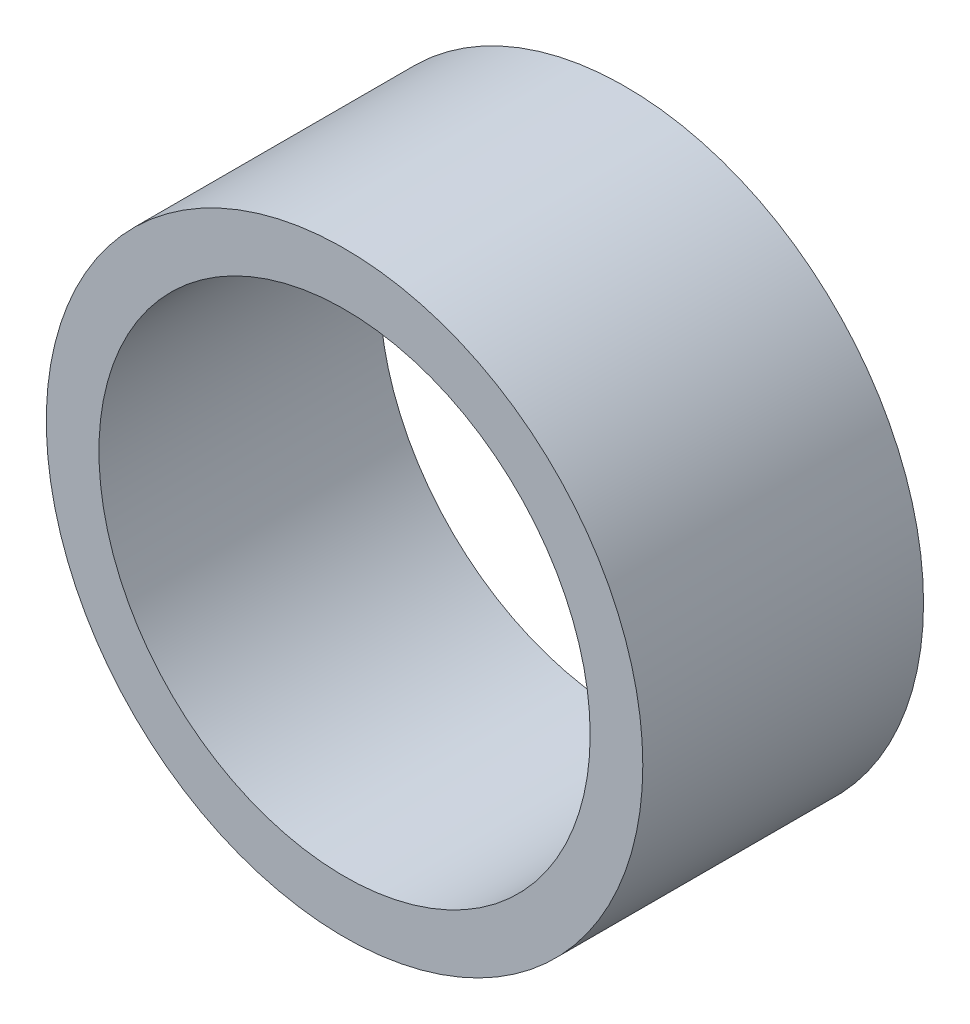
ISO-10303-21;
HEADER;
FILE_DESCRIPTION(('STEP AP214'),'2;1');
FILE_NAME('part.step','',(''),(''),'','','');
FILE_SCHEMA(('AUTOMOTIVE_DESIGN { 1 0 10303 214 1 1 1 1 }'));
ENDSEC;
DATA;
#1=APPLICATION_CONTEXT('core data for automotive mechanical design processes');
#2=APPLICATION_PROTOCOL_DEFINITION('international standard','automotive_design',2000,#1);
#3=PRODUCT_CONTEXT('',#1,'mechanical');
#4=PRODUCT('Part','Part','',(#3));
#5=PRODUCT_RELATED_PRODUCT_CATEGORY('part','',(#4));
#6=PRODUCT_DEFINITION_FORMATION('','',#4);
#7=PRODUCT_DEFINITION_CONTEXT('part definition',#1,'design');
#8=PRODUCT_DEFINITION('design','',#6,#7);
#9=PRODUCT_DEFINITION_SHAPE('','',#8);
#10=(LENGTH_UNIT() NAMED_UNIT(*) SI_UNIT(.MILLI.,.METRE.));
#11=(NAMED_UNIT(*) PLANE_ANGLE_UNIT() SI_UNIT($,.RADIAN.));
#12=(NAMED_UNIT(*) SI_UNIT($,.STERADIAN.) SOLID_ANGLE_UNIT());
#13=UNCERTAINTY_MEASURE_WITH_UNIT(LENGTH_MEASURE(1.E-05),#10,'distance_accuracy_value','');
#14=(GEOMETRIC_REPRESENTATION_CONTEXT(3) GLOBAL_UNCERTAINTY_ASSIGNED_CONTEXT((#13)) GLOBAL_UNIT_ASSIGNED_CONTEXT((#10,
#11,#12)) REPRESENTATION_CONTEXT('',''));
#15=CARTESIAN_POINT('',(0.,0.,0.));
#16=DIRECTION('',(0.,0.,1.));
#17=DIRECTION('',(1.,0.,0.));
#18=AXIS2_PLACEMENT_3D('',#15,#16,#17);
#19=CARTESIAN_POINT('',(0.,0.,8.));
#20=DIRECTION('',(0.,0.,1.));
#21=DIRECTION('',(1.,0.,0.));
#22=AXIS2_PLACEMENT_3D('',#19,#20,#21);
#23=PLANE('',#22);
#24=CARTESIAN_POINT('',(0.,0.,8.));
#25=DIRECTION('',(0.,0.,1.));
#26=DIRECTION('',(1.,0.,0.));
#27=AXIS2_PLACEMENT_3D('',#24,#25,#26);
#28=CIRCLE('',#27,8.5);
#29=CARTESIAN_POINT('',(8.5,0.,8.));
#30=VERTEX_POINT('',#29);
#31=EDGE_CURVE('E11',#30,#30,#28,.T.);
#32=ORIENTED_EDGE('',*,*,#31,.T.);
#33=EDGE_LOOP('',(#32));
#34=FACE_BOUND('',#33,.T.);
#35=CARTESIAN_POINT('',(0.,0.,8.));
#36=DIRECTION('',(0.,0.,1.));
#37=DIRECTION('',(1.,0.,0.));
#38=AXIS2_PLACEMENT_3D('',#35,#36,#37);
#39=CIRCLE('',#38,7.);
#40=CARTESIAN_POINT('',(7.,0.,8.));
#41=VERTEX_POINT('',#40);
#42=EDGE_CURVE('E47',#41,#41,#39,.T.);
#43=ORIENTED_EDGE('',*,*,#42,.F.);
#44=EDGE_LOOP('',(#43));
#45=FACE_BOUND('',#44,.T.);
#46=ADVANCED_FACE('F36',(#34,#45),#23,.T.);
#47=CARTESIAN_POINT('',(0.,0.,0.));
#48=DIRECTION('',(0.,0.,1.));
#49=DIRECTION('',(1.,0.,0.));
#50=AXIS2_PLACEMENT_3D('',#47,#48,#49);
#51=PLANE('',#50);
#52=CARTESIAN_POINT('',(0.,0.,0.));
#53=DIRECTION('',(0.,0.,1.));
#54=DIRECTION('',(1.,0.,0.));
#55=AXIS2_PLACEMENT_3D('',#52,#53,#54);
#56=CIRCLE('',#55,8.5);
#57=CARTESIAN_POINT('',(8.5,0.,0.));
#58=VERTEX_POINT('',#57);
#59=EDGE_CURVE('E40',#58,#58,#56,.T.);
#60=ORIENTED_EDGE('',*,*,#59,.F.);
#61=EDGE_LOOP('',(#60));
#62=FACE_BOUND('',#61,.T.);
#63=CARTESIAN_POINT('',(0.,0.,0.));
#64=DIRECTION('',(0.,0.,1.));
#65=DIRECTION('',(1.,0.,0.));
#66=AXIS2_PLACEMENT_3D('',#63,#64,#65);
#67=CIRCLE('',#66,7.);
#68=CARTESIAN_POINT('',(7.,0.,0.));
#69=VERTEX_POINT('',#68);
#70=EDGE_CURVE('E49',#69,#69,#67,.T.);
#71=ORIENTED_EDGE('',*,*,#70,.T.);
#72=EDGE_LOOP('',(#71));
#73=FACE_BOUND('',#72,.T.);
#74=ADVANCED_FACE('F59',(#62,#73),#51,.F.);
#75=CARTESIAN_POINT('',(0.,0.,8.));
#76=DIRECTION('',(0.,0.,-1.));
#77=DIRECTION('',(-1.,0.,0.));
#78=AXIS2_PLACEMENT_3D('',#75,#76,#77);
#79=CYLINDRICAL_SURFACE('',#78,8.5);
#80=ORIENTED_EDGE('',*,*,#31,.F.);
#81=EDGE_LOOP('',(#80));
#82=FACE_BOUND('',#81,.T.);
#83=ORIENTED_EDGE('',*,*,#59,.T.);
#84=EDGE_LOOP('',(#83));
#85=FACE_BOUND('',#84,.T.);
#86=ADVANCED_FACE('F38',(#82,#85),#79,.T.);
#87=CARTESIAN_POINT('',(0.,0.,8.));
#88=DIRECTION('',(0.,0.,-1.));
#89=DIRECTION('',(-1.,0.,0.));
#90=AXIS2_PLACEMENT_3D('',#87,#88,#89);
#91=CYLINDRICAL_SURFACE('',#90,7.);
#92=ORIENTED_EDGE('',*,*,#42,.T.);
#93=EDGE_LOOP('',(#92));
#94=FACE_BOUND('',#93,.T.);
#95=ORIENTED_EDGE('',*,*,#70,.F.);
#96=EDGE_LOOP('',(#95));
#97=FACE_BOUND('',#96,.T.);
#98=ADVANCED_FACE('F55',(#94,#97),#91,.F.);
#99=CLOSED_SHELL('',(#46,#74,#86,#98));
#100=MANIFOLD_SOLID_BREP('B2',#99);
#101=ADVANCED_BREP_SHAPE_REPRESENTATION('',(#18,#100),#14);
#102=SHAPE_DEFINITION_REPRESENTATION(#9,#101);
ENDSEC;
END-ISO-10303-21;
